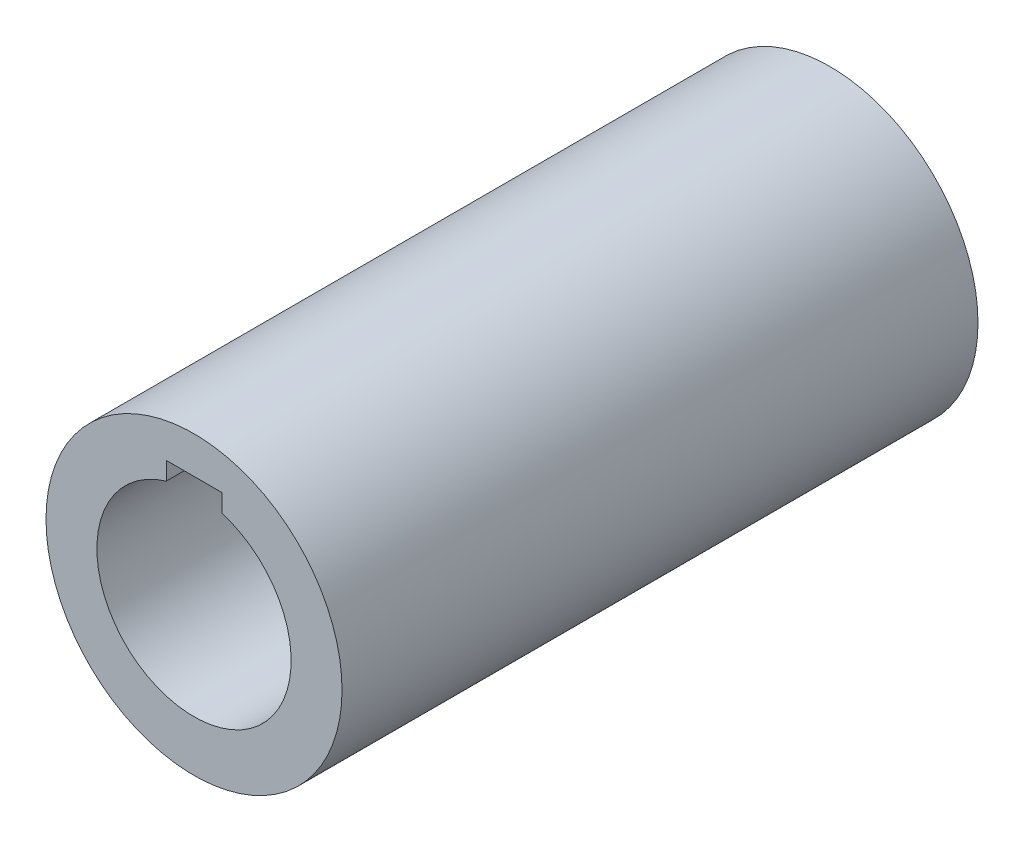
ISO-10303-21;
HEADER;
FILE_DESCRIPTION(('STEP AP214'),'2;1');
FILE_NAME('part.step','',(''),(''),'','','');
FILE_SCHEMA(('AUTOMOTIVE_DESIGN { 1 0 10303 214 1 1 1 1 }'));
ENDSEC;
DATA;
#1=APPLICATION_CONTEXT('core data for automotive mechanical design processes');
#2=APPLICATION_PROTOCOL_DEFINITION('international standard','automotive_design',2000,#1);
#3=PRODUCT_CONTEXT('',#1,'mechanical');
#4=PRODUCT('Part','Part','',(#3));
#5=PRODUCT_RELATED_PRODUCT_CATEGORY('part','',(#4));
#6=PRODUCT_DEFINITION_FORMATION('','',#4);
#7=PRODUCT_DEFINITION_CONTEXT('part definition',#1,'design');
#8=PRODUCT_DEFINITION('design','',#6,#7);
#9=PRODUCT_DEFINITION_SHAPE('','',#8);
#10=(LENGTH_UNIT() NAMED_UNIT(*) SI_UNIT(.MILLI.,.METRE.));
#11=(NAMED_UNIT(*) PLANE_ANGLE_UNIT() SI_UNIT($,.RADIAN.));
#12=(NAMED_UNIT(*) SI_UNIT($,.STERADIAN.) SOLID_ANGLE_UNIT());
#13=UNCERTAINTY_MEASURE_WITH_UNIT(LENGTH_MEASURE(1.E-05),#10,'distance_accuracy_value','');
#14=(GEOMETRIC_REPRESENTATION_CONTEXT(3) GLOBAL_UNCERTAINTY_ASSIGNED_CONTEXT((#13)) GLOBAL_UNIT_ASSIGNED_CONTEXT((#10,
#11,#12)) REPRESENTATION_CONTEXT('',''));
#15=CARTESIAN_POINT('',(0.,0.,0.));
#16=DIRECTION('',(0.,0.,1.));
#17=DIRECTION('',(1.,0.,0.));
#18=AXIS2_PLACEMENT_3D('',#15,#16,#17);
#19=CARTESIAN_POINT('',(0.,0.,137.5));
#20=DIRECTION('',(0.,0.,1.));
#21=DIRECTION('',(1.,0.,0.));
#22=AXIS2_PLACEMENT_3D('',#19,#20,#21);
#23=PLANE('',#22);
#24=DIRECTION('',(0.,-1.,0.));
#25=VECTOR('',#24,1.);
#26=CARTESIAN_POINT('',(-6.,24.,137.5));
#27=LINE('',#26,#25);
#28=CARTESIAN_POINT('',(-6.,24.,137.5));
#29=VERTEX_POINT('',#28);
#30=CARTESIAN_POINT('',(-6.,20.1246117974981,137.5));
#31=VERTEX_POINT('',#30);
#32=EDGE_CURVE('E80',#29,#31,#27,.T.);
#33=ORIENTED_EDGE('',*,*,#32,.F.);
#34=DIRECTION('',(-1.,0.,0.));
#35=VECTOR('',#34,1.);
#36=CARTESIAN_POINT('',(-6.,24.,137.5));
#37=LINE('',#36,#35);
#38=CARTESIAN_POINT('',(6.,24.,137.5));
#39=VERTEX_POINT('',#38);
#40=EDGE_CURVE('E92',#39,#29,#37,.T.);
#41=ORIENTED_EDGE('',*,*,#40,.F.);
#42=DIRECTION('',(0.,1.,0.));
#43=VECTOR('',#42,1.);
#44=CARTESIAN_POINT('',(6.,24.,137.5));
#45=LINE('',#44,#43);
#46=CARTESIAN_POINT('',(6.,20.1246117974981,137.5));
#47=VERTEX_POINT('',#46);
#48=EDGE_CURVE('E104',#47,#39,#45,.T.);
#49=ORIENTED_EDGE('',*,*,#48,.F.);
#50=CARTESIAN_POINT('',(0.,0.,137.5));
#51=DIRECTION('',(0.,0.,1.));
#52=DIRECTION('',(1.,0.,0.));
#53=AXIS2_PLACEMENT_3D('',#50,#51,#52);
#54=CIRCLE('',#53,21.);
#55=EDGE_CURVE('E95',#31,#47,#54,.T.);
#56=ORIENTED_EDGE('',*,*,#55,.F.);
#57=EDGE_LOOP('',(#33,#41,#49,#56));
#58=FACE_BOUND('',#57,.T.);
#59=CARTESIAN_POINT('',(0.,0.,137.5));
#60=DIRECTION('',(0.,0.,1.));
#61=DIRECTION('',(1.,0.,0.));
#62=AXIS2_PLACEMENT_3D('',#59,#60,#61);
#63=CIRCLE('',#62,32.);
#64=CARTESIAN_POINT('',(32.,0.,137.5));
#65=VERTEX_POINT('',#64);
#66=EDGE_CURVE('E11',#65,#65,#63,.T.);
#67=ORIENTED_EDGE('',*,*,#66,.T.);
#68=EDGE_LOOP('',(#67));
#69=FACE_BOUND('',#68,.T.);
#70=ADVANCED_FACE('F33',(#58,#69),#23,.T.);
#71=CARTESIAN_POINT('',(0.,0.,0.));
#72=DIRECTION('',(0.,0.,1.));
#73=DIRECTION('',(1.,0.,0.));
#74=AXIS2_PLACEMENT_3D('',#71,#72,#73);
#75=PLANE('',#74);
#76=CARTESIAN_POINT('',(0.,0.,0.));
#77=DIRECTION('',(0.,0.,1.));
#78=DIRECTION('',(1.,0.,0.));
#79=AXIS2_PLACEMENT_3D('',#76,#77,#78);
#80=CIRCLE('',#79,32.);
#81=CARTESIAN_POINT('',(32.,0.,0.));
#82=VERTEX_POINT('',#81);
#83=EDGE_CURVE('E37',#82,#82,#80,.T.);
#84=ORIENTED_EDGE('',*,*,#83,.F.);
#85=EDGE_LOOP('',(#84));
#86=FACE_BOUND('',#85,.T.);
#87=DIRECTION('',(-1.,0.,0.));
#88=VECTOR('',#87,1.);
#89=CARTESIAN_POINT('',(-6.,24.,0.));
#90=LINE('',#89,#88);
#91=CARTESIAN_POINT('',(6.,24.,0.));
#92=VERTEX_POINT('',#91);
#93=CARTESIAN_POINT('',(-6.,24.,0.));
#94=VERTEX_POINT('',#93);
#95=EDGE_CURVE('E86',#92,#94,#90,.T.);
#96=ORIENTED_EDGE('',*,*,#95,.T.);
#97=DIRECTION('',(0.,-1.,0.));
#98=VECTOR('',#97,1.);
#99=CARTESIAN_POINT('',(-6.,24.,0.));
#100=LINE('',#99,#98);
#101=CARTESIAN_POINT('',(-6.,20.1246117974981,0.));
#102=VERTEX_POINT('',#101);
#103=EDGE_CURVE('E77',#94,#102,#100,.T.);
#104=ORIENTED_EDGE('',*,*,#103,.T.);
#105=CARTESIAN_POINT('',(0.,0.,0.));
#106=DIRECTION('',(0.,0.,1.));
#107=DIRECTION('',(1.,0.,0.));
#108=AXIS2_PLACEMENT_3D('',#105,#106,#107);
#109=CIRCLE('',#108,21.);
#110=CARTESIAN_POINT('',(6.,20.1246117974981,0.));
#111=VERTEX_POINT('',#110);
#112=EDGE_CURVE('E91',#102,#111,#109,.T.);
#113=ORIENTED_EDGE('',*,*,#112,.T.);
#114=DIRECTION('',(0.,1.,0.));
#115=VECTOR('',#114,1.);
#116=CARTESIAN_POINT('',(6.,24.,0.));
#117=LINE('',#116,#115);
#118=EDGE_CURVE('E48',#111,#92,#117,.T.);
#119=ORIENTED_EDGE('',*,*,#118,.T.);
#120=EDGE_LOOP('',(#96,#104,#113,#119));
#121=FACE_BOUND('',#120,.T.);
#122=ADVANCED_FACE('F90',(#86,#121),#75,.F.);
#123=CARTESIAN_POINT('',(0.,0.,137.5));
#124=DIRECTION('',(0.,0.,-1.));
#125=DIRECTION('',(-1.,0.,0.));
#126=AXIS2_PLACEMENT_3D('',#123,#124,#125);
#127=CYLINDRICAL_SURFACE('',#126,32.);
#128=ORIENTED_EDGE('',*,*,#66,.F.);
#129=EDGE_LOOP('',(#128));
#130=FACE_BOUND('',#129,.T.);
#131=ORIENTED_EDGE('',*,*,#83,.T.);
#132=EDGE_LOOP('',(#131));
#133=FACE_BOUND('',#132,.T.);
#134=ADVANCED_FACE('F35',(#130,#133),#127,.T.);
#135=CARTESIAN_POINT('',(0.,0.,137.5));
#136=DIRECTION('',(0.,0.,-1.));
#137=DIRECTION('',(-1.,0.,0.));
#138=AXIS2_PLACEMENT_3D('',#135,#136,#137);
#139=CYLINDRICAL_SURFACE('',#138,21.);
#140=DIRECTION('',(0.,0.,1.));
#141=VECTOR('',#140,1.);
#142=CARTESIAN_POINT('',(-6.,20.1246117974981,0.));
#143=LINE('',#142,#141);
#144=EDGE_CURVE('E74',#102,#31,#143,.T.);
#145=ORIENTED_EDGE('',*,*,#144,.T.);
#146=ORIENTED_EDGE('',*,*,#55,.T.);
#147=DIRECTION('',(0.,0.,1.));
#148=VECTOR('',#147,1.);
#149=CARTESIAN_POINT('',(6.,20.1246117974981,0.));
#150=LINE('',#149,#148);
#151=EDGE_CURVE('E85',#111,#47,#150,.T.);
#152=ORIENTED_EDGE('',*,*,#151,.F.);
#153=ORIENTED_EDGE('',*,*,#112,.F.);
#154=EDGE_LOOP('',(#145,#146,#152,#153));
#155=FACE_BOUND('',#154,.T.);
#156=ADVANCED_FACE('F94',(#155),#139,.F.);
#157=CARTESIAN_POINT('',(-6.,24.,0.));
#158=DIRECTION('',(-1.,0.,0.));
#159=DIRECTION('',(0.,-1.,0.));
#160=AXIS2_PLACEMENT_3D('',#157,#158,#159);
#161=PLANE('',#160);
#162=ORIENTED_EDGE('',*,*,#32,.T.);
#163=ORIENTED_EDGE('',*,*,#144,.F.);
#164=ORIENTED_EDGE('',*,*,#103,.F.);
#165=DIRECTION('',(0.,0.,1.));
#166=VECTOR('',#165,1.);
#167=CARTESIAN_POINT('',(-6.,24.,0.));
#168=LINE('',#167,#166);
#169=EDGE_CURVE('E57',#94,#29,#168,.T.);
#170=ORIENTED_EDGE('',*,*,#169,.T.);
#171=EDGE_LOOP('',(#162,#163,#164,#170));
#172=FACE_BOUND('',#171,.T.);
#173=ADVANCED_FACE('F76',(#172),#161,.F.);
#174=CARTESIAN_POINT('',(-6.,24.,0.));
#175=DIRECTION('',(0.,1.,0.));
#176=DIRECTION('',(0.,0.,1.));
#177=AXIS2_PLACEMENT_3D('',#174,#175,#176);
#178=PLANE('',#177);
#179=ORIENTED_EDGE('',*,*,#40,.T.);
#180=ORIENTED_EDGE('',*,*,#169,.F.);
#181=ORIENTED_EDGE('',*,*,#95,.F.);
#182=DIRECTION('',(0.,0.,1.));
#183=VECTOR('',#182,1.);
#184=CARTESIAN_POINT('',(6.,24.,0.));
#185=LINE('',#184,#183);
#186=EDGE_CURVE('E98',#92,#39,#185,.T.);
#187=ORIENTED_EDGE('',*,*,#186,.T.);
#188=EDGE_LOOP('',(#179,#180,#181,#187));
#189=FACE_BOUND('',#188,.T.);
#190=ADVANCED_FACE('F114',(#189),#178,.F.);
#191=CARTESIAN_POINT('',(6.,24.,0.));
#192=DIRECTION('',(1.,0.,0.));
#193=DIRECTION('',(0.,1.,0.));
#194=AXIS2_PLACEMENT_3D('',#191,#192,#193);
#195=PLANE('',#194);
#196=ORIENTED_EDGE('',*,*,#48,.T.);
#197=ORIENTED_EDGE('',*,*,#186,.F.);
#198=ORIENTED_EDGE('',*,*,#118,.F.);
#199=ORIENTED_EDGE('',*,*,#151,.T.);
#200=EDGE_LOOP('',(#196,#197,#198,#199));
#201=FACE_BOUND('',#200,.T.);
#202=ADVANCED_FACE('F111',(#201),#195,.F.);
#203=CLOSED_SHELL('',(#70,#122,#134,#156,#173,#190,#202));
#204=MANIFOLD_SOLID_BREP('B2',#203);
#205=ADVANCED_BREP_SHAPE_REPRESENTATION('',(#18,#204),#14);
#206=SHAPE_DEFINITION_REPRESENTATION(#9,#205);
ENDSEC;
END-ISO-10303-21;
